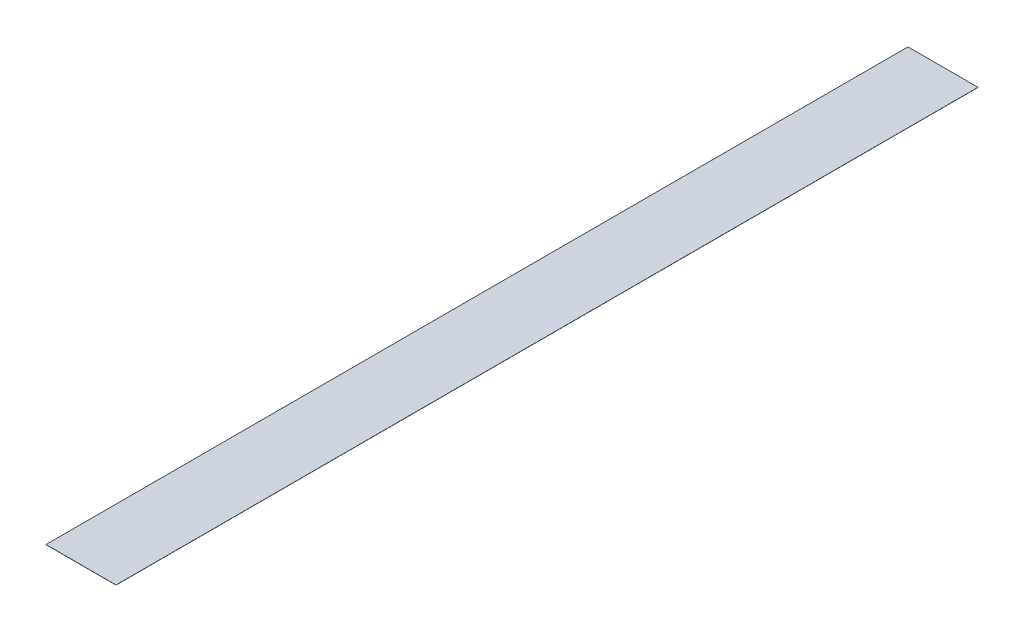
ISO-10303-21;
HEADER;
FILE_DESCRIPTION(('STEP AP214'),'2;1');
FILE_NAME('part.step','',(''),(''),'','','');
FILE_SCHEMA(('AUTOMOTIVE_DESIGN { 1 0 10303 214 1 1 1 1 }'));
ENDSEC;
DATA;
#1=APPLICATION_CONTEXT('core data for automotive mechanical design processes');
#2=APPLICATION_PROTOCOL_DEFINITION('international standard','automotive_design',2000,#1);
#3=PRODUCT_CONTEXT('',#1,'mechanical');
#4=PRODUCT('Part','Part','',(#3));
#5=PRODUCT_RELATED_PRODUCT_CATEGORY('part','',(#4));
#6=PRODUCT_DEFINITION_FORMATION('','',#4);
#7=PRODUCT_DEFINITION_CONTEXT('part definition',#1,'design');
#8=PRODUCT_DEFINITION('design','',#6,#7);
#9=PRODUCT_DEFINITION_SHAPE('','',#8);
#10=(LENGTH_UNIT() NAMED_UNIT(*) SI_UNIT(.MILLI.,.METRE.));
#11=(NAMED_UNIT(*) PLANE_ANGLE_UNIT() SI_UNIT($,.RADIAN.));
#12=(NAMED_UNIT(*) SI_UNIT($,.STERADIAN.) SOLID_ANGLE_UNIT());
#13=UNCERTAINTY_MEASURE_WITH_UNIT(LENGTH_MEASURE(1.E-05),#10,'distance_accuracy_value','');
#14=(GEOMETRIC_REPRESENTATION_CONTEXT(3) GLOBAL_UNCERTAINTY_ASSIGNED_CONTEXT((#13)) GLOBAL_UNIT_ASSIGNED_CONTEXT((#10,
#11,#12)) REPRESENTATION_CONTEXT('',''));
#15=CARTESIAN_POINT('',(0.,0.,0.));
#16=DIRECTION('',(0.,0.,1.));
#17=DIRECTION('',(1.,0.,0.));
#18=AXIS2_PLACEMENT_3D('',#15,#16,#17);
#19=CARTESIAN_POINT('',(-12.45,0.0508,-153.25));
#20=DIRECTION('',(1.,0.,0.));
#21=DIRECTION('',(0.,0.,-1.));
#22=AXIS2_PLACEMENT_3D('',#19,#20,#21);
#23=PLANE('',#22);
#24=DIRECTION('',(0.,0.,1.));
#25=VECTOR('',#24,1.);
#26=CARTESIAN_POINT('',(-12.45,0.,-153.25));
#27=LINE('',#26,#25);
#28=CARTESIAN_POINT('',(-12.45,0.,-153.25));
#29=VERTEX_POINT('',#28);
#30=CARTESIAN_POINT('',(-12.45,0.,153.25));
#31=VERTEX_POINT('',#30);
#32=EDGE_CURVE('E96',#29,#31,#27,.T.);
#33=ORIENTED_EDGE('',*,*,#32,.T.);
#34=DIRECTION('',(0.,-1.,0.));
#35=VECTOR('',#34,1.);
#36=CARTESIAN_POINT('',(-12.45,0.0508,153.25));
#37=LINE('',#36,#35);
#38=CARTESIAN_POINT('',(-12.45,0.0508,153.25));
#39=VERTEX_POINT('',#38);
#40=EDGE_CURVE('E11',#39,#31,#37,.T.);
#41=ORIENTED_EDGE('',*,*,#40,.F.);
#42=DIRECTION('',(0.,0.,1.));
#43=VECTOR('',#42,1.);
#44=CARTESIAN_POINT('',(-12.45,0.0508,-153.25));
#45=LINE('',#44,#43);
#46=CARTESIAN_POINT('',(-12.45,0.0508,-153.25));
#47=VERTEX_POINT('',#46);
#48=EDGE_CURVE('E84',#47,#39,#45,.T.);
#49=ORIENTED_EDGE('',*,*,#48,.F.);
#50=DIRECTION('',(0.,-1.,0.));
#51=VECTOR('',#50,1.);
#52=CARTESIAN_POINT('',(-12.45,0.0508,-153.25));
#53=LINE('',#52,#51);
#54=EDGE_CURVE('E92',#47,#29,#53,.T.);
#55=ORIENTED_EDGE('',*,*,#54,.T.);
#56=EDGE_LOOP('',(#33,#41,#49,#55));
#57=FACE_BOUND('',#56,.T.);
#58=ADVANCED_FACE('F33',(#57),#23,.F.);
#59=CARTESIAN_POINT('',(-12.45,0.0508,153.25));
#60=DIRECTION('',(0.,0.,-1.));
#61=DIRECTION('',(-1.,0.,0.));
#62=AXIS2_PLACEMENT_3D('',#59,#60,#61);
#63=PLANE('',#62);
#64=DIRECTION('',(1.,0.,0.));
#65=VECTOR('',#64,1.);
#66=CARTESIAN_POINT('',(-12.45,0.,153.25));
#67=LINE('',#66,#65);
#68=CARTESIAN_POINT('',(12.45,0.,153.25));
#69=VERTEX_POINT('',#68);
#70=EDGE_CURVE('E88',#31,#69,#67,.T.);
#71=ORIENTED_EDGE('',*,*,#70,.T.);
#72=DIRECTION('',(0.,-1.,0.));
#73=VECTOR('',#72,1.);
#74=CARTESIAN_POINT('',(12.45,0.0508,153.25));
#75=LINE('',#74,#73);
#76=CARTESIAN_POINT('',(12.45,0.0508,153.25));
#77=VERTEX_POINT('',#76);
#78=EDGE_CURVE('E41',#77,#69,#75,.T.);
#79=ORIENTED_EDGE('',*,*,#78,.F.);
#80=DIRECTION('',(1.,0.,0.));
#81=VECTOR('',#80,1.);
#82=CARTESIAN_POINT('',(-12.45,0.0508,153.25));
#83=LINE('',#82,#81);
#84=EDGE_CURVE('E79',#39,#77,#83,.T.);
#85=ORIENTED_EDGE('',*,*,#84,.F.);
#86=ORIENTED_EDGE('',*,*,#40,.T.);
#87=EDGE_LOOP('',(#71,#79,#85,#86));
#88=FACE_BOUND('',#87,.T.);
#89=ADVANCED_FACE('F87',(#88),#63,.F.);
#90=CARTESIAN_POINT('',(12.45,0.0508,-153.25));
#91=DIRECTION('',(-1.,0.,0.));
#92=DIRECTION('',(0.,0.,1.));
#93=AXIS2_PLACEMENT_3D('',#90,#91,#92);
#94=PLANE('',#93);
#95=DIRECTION('',(0.,0.,-1.));
#96=VECTOR('',#95,1.);
#97=CARTESIAN_POINT('',(12.45,0.,-153.25));
#98=LINE('',#97,#96);
#99=CARTESIAN_POINT('',(12.45,0.,-153.25));
#100=VERTEX_POINT('',#99);
#101=EDGE_CURVE('E66',#69,#100,#98,.T.);
#102=ORIENTED_EDGE('',*,*,#101,.T.);
#103=DIRECTION('',(0.,-1.,0.));
#104=VECTOR('',#103,1.);
#105=CARTESIAN_POINT('',(12.45,0.0508,-153.25));
#106=LINE('',#105,#104);
#107=CARTESIAN_POINT('',(12.45,0.0508,-153.25));
#108=VERTEX_POINT('',#107);
#109=EDGE_CURVE('E89',#108,#100,#106,.T.);
#110=ORIENTED_EDGE('',*,*,#109,.F.);
#111=DIRECTION('',(0.,0.,-1.));
#112=VECTOR('',#111,1.);
#113=CARTESIAN_POINT('',(12.45,0.0508,-153.25));
#114=LINE('',#113,#112);
#115=EDGE_CURVE('E82',#77,#108,#114,.T.);
#116=ORIENTED_EDGE('',*,*,#115,.F.);
#117=ORIENTED_EDGE('',*,*,#78,.T.);
#118=EDGE_LOOP('',(#102,#110,#116,#117));
#119=FACE_BOUND('',#118,.T.);
#120=ADVANCED_FACE('F90',(#119),#94,.F.);
#121=CARTESIAN_POINT('',(-12.45,0.0508,-153.25));
#122=DIRECTION('',(0.,0.,1.));
#123=DIRECTION('',(1.,0.,0.));
#124=AXIS2_PLACEMENT_3D('',#121,#122,#123);
#125=PLANE('',#124);
#126=DIRECTION('',(-1.,0.,0.));
#127=VECTOR('',#126,1.);
#128=CARTESIAN_POINT('',(-12.45,0.,-153.25));
#129=LINE('',#128,#127);
#130=EDGE_CURVE('E72',#100,#29,#129,.T.);
#131=ORIENTED_EDGE('',*,*,#130,.T.);
#132=ORIENTED_EDGE('',*,*,#54,.F.);
#133=DIRECTION('',(-1.,0.,0.));
#134=VECTOR('',#133,1.);
#135=CARTESIAN_POINT('',(-12.45,0.0508,-153.25));
#136=LINE('',#135,#134);
#137=EDGE_CURVE('E49',#108,#47,#136,.T.);
#138=ORIENTED_EDGE('',*,*,#137,.F.);
#139=ORIENTED_EDGE('',*,*,#109,.T.);
#140=EDGE_LOOP('',(#131,#132,#138,#139));
#141=FACE_BOUND('',#140,.T.);
#142=ADVANCED_FACE('F103',(#141),#125,.F.);
#143=CARTESIAN_POINT('',(-12.45,0.0508,153.25));
#144=DIRECTION('',(0.,1.,0.));
#145=DIRECTION('',(0.,0.,1.));
#146=AXIS2_PLACEMENT_3D('',#143,#144,#145);
#147=PLANE('',#146);
#148=ORIENTED_EDGE('',*,*,#48,.T.);
#149=ORIENTED_EDGE('',*,*,#84,.T.);
#150=ORIENTED_EDGE('',*,*,#115,.T.);
#151=ORIENTED_EDGE('',*,*,#137,.T.);
#152=EDGE_LOOP('',(#148,#149,#150,#151));
#153=FACE_BOUND('',#152,.T.);
#154=ADVANCED_FACE('F80',(#153),#147,.T.);
#155=CARTESIAN_POINT('',(-12.45,0.,153.25));
#156=DIRECTION('',(0.,1.,0.));
#157=DIRECTION('',(0.,0.,1.));
#158=AXIS2_PLACEMENT_3D('',#155,#156,#157);
#159=PLANE('',#158);
#160=ORIENTED_EDGE('',*,*,#32,.F.);
#161=ORIENTED_EDGE('',*,*,#130,.F.);
#162=ORIENTED_EDGE('',*,*,#101,.F.);
#163=ORIENTED_EDGE('',*,*,#70,.F.);
#164=EDGE_LOOP('',(#160,#161,#162,#163));
#165=FACE_BOUND('',#164,.T.);
#166=ADVANCED_FACE('F106',(#165),#159,.F.);
#167=CLOSED_SHELL('',(#58,#89,#120,#142,#154,#166));
#168=MANIFOLD_SOLID_BREP('B2',#167);
#169=ADVANCED_BREP_SHAPE_REPRESENTATION('',(#18,#168),#14);
#170=SHAPE_DEFINITION_REPRESENTATION(#9,#169);
ENDSEC;
END-ISO-10303-21;
